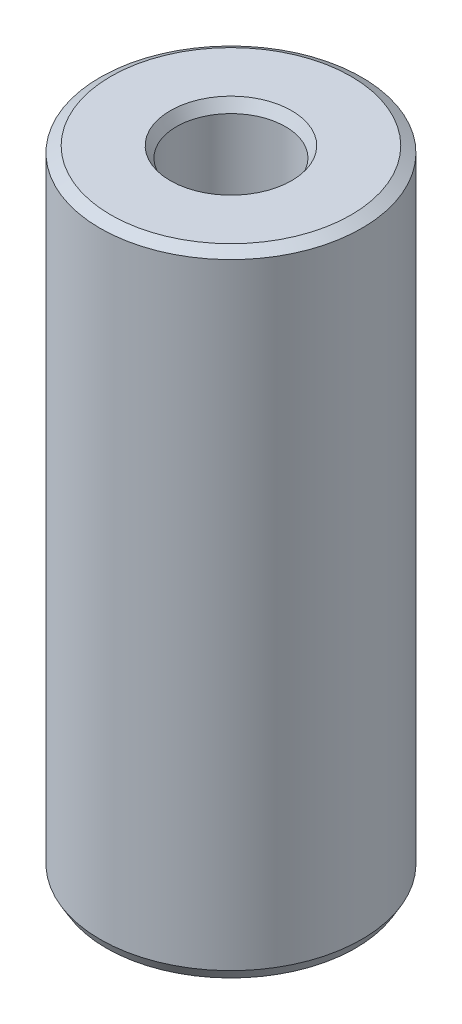
ISO-10303-21;
HEADER;
FILE_DESCRIPTION(('STEP AP214'),'2;1');
FILE_NAME('part.step','',(''),(''),'','','');
FILE_SCHEMA(('AUTOMOTIVE_DESIGN { 1 0 10303 214 1 1 1 1 }'));
ENDSEC;
DATA;
#1=APPLICATION_CONTEXT('core data for automotive mechanical design processes');
#2=APPLICATION_PROTOCOL_DEFINITION('international standard','automotive_design',2000,#1);
#3=PRODUCT_CONTEXT('',#1,'mechanical');
#4=PRODUCT('Part','Part','',(#3));
#5=PRODUCT_RELATED_PRODUCT_CATEGORY('part','',(#4));
#6=PRODUCT_DEFINITION_FORMATION('','',#4);
#7=PRODUCT_DEFINITION_CONTEXT('part definition',#1,'design');
#8=PRODUCT_DEFINITION('design','',#6,#7);
#9=PRODUCT_DEFINITION_SHAPE('','',#8);
#10=(LENGTH_UNIT() NAMED_UNIT(*) SI_UNIT(.MILLI.,.METRE.));
#11=(NAMED_UNIT(*) PLANE_ANGLE_UNIT() SI_UNIT($,.RADIAN.));
#12=(NAMED_UNIT(*) SI_UNIT($,.STERADIAN.) SOLID_ANGLE_UNIT());
#13=UNCERTAINTY_MEASURE_WITH_UNIT(LENGTH_MEASURE(1.E-05),#10,'distance_accuracy_value','');
#14=(GEOMETRIC_REPRESENTATION_CONTEXT(3) GLOBAL_UNCERTAINTY_ASSIGNED_CONTEXT((#13)) GLOBAL_UNIT_ASSIGNED_CONTEXT((#10,
#11,#12)) REPRESENTATION_CONTEXT('',''));
#15=CARTESIAN_POINT('',(0.,0.,0.));
#16=DIRECTION('',(0.,0.,1.));
#17=DIRECTION('',(1.,0.,0.));
#18=AXIS2_PLACEMENT_3D('',#15,#16,#17);
#19=CARTESIAN_POINT('',(0.,278.101247653803,0.));
#20=DIRECTION('',(0.,-1.,0.));
#21=DIRECTION('',(0.,0.,-1.));
#22=AXIS2_PLACEMENT_3D('',#19,#20,#21);
#23=CYLINDRICAL_SURFACE('',#22,57.5);
#24=CARTESIAN_POINT('',(0.,4.71652460681038,0.));
#25=DIRECTION('',(0.,1.,0.));
#26=DIRECTION('',(0.,0.,1.));
#27=AXIS2_PLACEMENT_3D('',#24,#25,#26);
#28=CIRCLE('',#27,57.5);
#29=CARTESIAN_POINT('',(0.,4.71652460681038,57.5));
#30=VERTEX_POINT('',#29);
#31=EDGE_CURVE('E10',#30,#30,#28,.T.);
#32=ORIENTED_EDGE('',*,*,#31,.T.);
#33=EDGE_LOOP('',(#32));
#34=FACE_BOUND('',#33,.T.);
#35=CARTESIAN_POINT('',(0.,275.378160902422,0.));
#36=DIRECTION('',(0.,1.,0.));
#37=DIRECTION('',(0.,0.,1.));
#38=AXIS2_PLACEMENT_3D('',#35,#36,#37);
#39=CIRCLE('',#38,57.5);
#40=CARTESIAN_POINT('',(0.,275.378160902422,57.5));
#41=VERTEX_POINT('',#40);
#42=EDGE_CURVE('E50',#41,#41,#39,.F.);
#43=ORIENTED_EDGE('',*,*,#42,.T.);
#44=EDGE_LOOP('',(#43));
#45=FACE_BOUND('',#44,.T.);
#46=ADVANCED_FACE('F39',(#34,#45),#23,.T.);
#47=CARTESIAN_POINT('',(0.,278.101247653803,0.));
#48=DIRECTION('',(0.,1.,0.));
#49=DIRECTION('',(0.,0.,1.));
#50=AXIS2_PLACEMENT_3D('',#47,#48,#49);
#51=PLANE('',#50);
#52=CARTESIAN_POINT('',(0.,278.101247653803,0.));
#53=DIRECTION('',(0.,1.,0.));
#54=DIRECTION('',(0.,0.,1.));
#55=AXIS2_PLACEMENT_3D('',#52,#53,#54);
#56=CIRCLE('',#55,26.6731437150087);
#57=CARTESIAN_POINT('',(0.,278.101247653803,26.6731437150087));
#58=VERTEX_POINT('',#57);
#59=EDGE_CURVE('E58',#58,#58,#56,.F.);
#60=ORIENTED_EDGE('',*,*,#59,.T.);
#61=EDGE_LOOP('',(#60));
#62=FACE_BOUND('',#61,.T.);
#63=CARTESIAN_POINT('',(0.,278.101247653803,0.));
#64=DIRECTION('',(0.,1.,0.));
#65=DIRECTION('',(0.,0.,1.));
#66=AXIS2_PLACEMENT_3D('',#63,#64,#65);
#67=CIRCLE('',#66,52.7834753931897);
#68=CARTESIAN_POINT('',(0.,278.101247653803,52.7834753931897));
#69=VERTEX_POINT('',#68);
#70=EDGE_CURVE('E61',#69,#69,#67,.T.);
#71=ORIENTED_EDGE('',*,*,#70,.T.);
#72=EDGE_LOOP('',(#71));
#73=FACE_BOUND('',#72,.T.);
#74=ADVANCED_FACE('F88',(#62,#73),#51,.T.);
#75=CARTESIAN_POINT('',(0.,0.,0.));
#76=DIRECTION('',(0.,1.,0.));
#77=DIRECTION('',(0.,0.,1.));
#78=AXIS2_PLACEMENT_3D('',#75,#76,#77);
#79=PLANE('',#78);
#80=CARTESIAN_POINT('',(0.,0.,0.));
#81=DIRECTION('',(0.,1.,0.));
#82=DIRECTION('',(0.,0.,1.));
#83=AXIS2_PLACEMENT_3D('',#80,#81,#82);
#84=CIRCLE('',#83,28.6665815704376);
#85=CARTESIAN_POINT('',(0.,0.,28.6665815704376));
#86=VERTEX_POINT('',#85);
#87=EDGE_CURVE('E51',#86,#86,#84,.T.);
#88=ORIENTED_EDGE('',*,*,#87,.T.);
#89=EDGE_LOOP('',(#88));
#90=FACE_BOUND('',#89,.T.);
#91=CARTESIAN_POINT('',(0.,0.,0.));
#92=DIRECTION('',(0.,1.,0.));
#93=DIRECTION('',(0.,0.,1.));
#94=AXIS2_PLACEMENT_3D('',#91,#92,#93);
#95=CIRCLE('',#94,54.7769132486185);
#96=CARTESIAN_POINT('',(0.,0.,54.7769132486185));
#97=VERTEX_POINT('',#96);
#98=EDGE_CURVE('E54',#97,#97,#95,.F.);
#99=ORIENTED_EDGE('',*,*,#98,.T.);
#100=EDGE_LOOP('',(#99));
#101=FACE_BOUND('',#100,.T.);
#102=ADVANCED_FACE('F83',(#90,#101),#79,.F.);
#103=CARTESIAN_POINT('',(0.,278.101247653803,0.));
#104=DIRECTION('',(0.,-1.,0.));
#105=DIRECTION('',(0.,0.,-1.));
#106=AXIS2_PLACEMENT_3D('',#103,#104,#105);
#107=CYLINDRICAL_SURFACE('',#106,23.9500569636272);
#108=CARTESIAN_POINT('',(0.,273.384723046993,0.));
#109=DIRECTION('',(0.,1.,0.));
#110=DIRECTION('',(0.,0.,1.));
#111=AXIS2_PLACEMENT_3D('',#108,#109,#110);
#112=CIRCLE('',#111,23.9500569636272);
#113=CARTESIAN_POINT('',(0.,273.384723046993,23.9500569636271));
#114=VERTEX_POINT('',#113);
#115=EDGE_CURVE('E67',#114,#114,#112,.T.);
#116=ORIENTED_EDGE('',*,*,#115,.T.);
#117=EDGE_LOOP('',(#116));
#118=FACE_BOUND('',#117,.T.);
#119=CARTESIAN_POINT('',(0.,2.7230867513815,0.));
#120=DIRECTION('',(0.,1.,0.));
#121=DIRECTION('',(0.,0.,1.));
#122=AXIS2_PLACEMENT_3D('',#119,#120,#121);
#123=CIRCLE('',#122,23.9500569636272);
#124=CARTESIAN_POINT('',(0.,2.7230867513815,23.9500569636272));
#125=VERTEX_POINT('',#124);
#126=EDGE_CURVE('E69',#125,#125,#123,.F.);
#127=ORIENTED_EDGE('',*,*,#126,.T.);
#128=EDGE_LOOP('',(#127));
#129=FACE_BOUND('',#128,.T.);
#130=ADVANCED_FACE('F71',(#118,#129),#107,.F.);
#131=CARTESIAN_POINT('',(0.,273.384723046993,0.));
#132=DIRECTION('',(0.,1.,0.));
#133=DIRECTION('',(0.,0.,1.));
#134=AXIS2_PLACEMENT_3D('',#131,#132,#133);
#135=CONICAL_SURFACE('',#134,23.9500569636272,0.5235987755983);
#136=CARTESIAN_POINT('',(0.,278.101247653803,26.6731437150087));
#137=CARTESIAN_POINT('',(0.,278.052117189149,26.6447782280152));
#138=CARTESIAN_POINT('',(0.,278.002986724495,26.6164127410216));
#139=CARTESIAN_POINT('',(0.,277.904725795186,26.5596817670345));
#140=CARTESIAN_POINT('',(0.,277.855595330532,26.5313162800409));
#141=CARTESIAN_POINT('',(0.,277.757334401223,26.4745853060538));
#142=CARTESIAN_POINT('',(0.,277.708203936569,26.4462198190603));
#143=CARTESIAN_POINT('',(0.,277.60994300726,26.3894888450731));
#144=CARTESIAN_POINT('',(0.,277.560812542606,26.3611233580796));
#145=CARTESIAN_POINT('',(0.,277.462551613298,26.3043923840925));
#146=CARTESIAN_POINT('',(0.,277.413421148643,26.2760268970989));
#147=CARTESIAN_POINT('',(0.,277.315160219335,26.2192959231118));
#148=CARTESIAN_POINT('',(0.,277.26602975468,26.1909304361182));
#149=CARTESIAN_POINT('',(0.,277.167768825372,26.1341994621311));
#150=CARTESIAN_POINT('',(0.,277.118638360718,26.1058339751376));
#151=CARTESIAN_POINT('',(0.,277.020377431409,26.0491030011504));
#152=CARTESIAN_POINT('',(0.,276.971246966755,26.0207375141569));
#153=CARTESIAN_POINT('',(0.,276.872986037446,25.9640065401698));
#154=CARTESIAN_POINT('',(0.,276.823855572792,25.9356410531762));
#155=CARTESIAN_POINT('',(0.,276.725594643483,25.8789100791891));
#156=CARTESIAN_POINT('',(0.,276.676464178829,25.8505445921955));
#157=CARTESIAN_POINT('',(0.,276.578203249521,25.7938136182084));
#158=CARTESIAN_POINT('',(0.,276.529072784866,25.7654481312149));
#159=CARTESIAN_POINT('',(0.,276.430811855558,25.7087171572277));
#160=CARTESIAN_POINT('',(0.,276.381681390903,25.6803516702342));
#161=CARTESIAN_POINT('',(0.,276.283420461595,25.6236206962471));
#162=CARTESIAN_POINT('',(0.,276.234289996941,25.5952552092535));
#163=CARTESIAN_POINT('',(0.,276.136029067632,25.5385242352664));
#164=CARTESIAN_POINT('',(0.,276.086898602978,25.5101587482728));
#165=CARTESIAN_POINT('',(0.,275.988637673669,25.4534277742857));
#166=CARTESIAN_POINT('',(0.,275.939507209015,25.4250622872922));
#167=CARTESIAN_POINT('',(0.,275.841246279706,25.3683313133051));
#168=CARTESIAN_POINT('',(0.,275.792115815052,25.3399658263115));
#169=CARTESIAN_POINT('',(0.,275.693854885744,25.2832348523244));
#170=CARTESIAN_POINT('',(0.,275.644724421089,25.2548693653308));
#171=CARTESIAN_POINT('',(0.,275.546463491781,25.1981383913437));
#172=CARTESIAN_POINT('',(0.,275.497333027126,25.1697729043501));
#173=CARTESIAN_POINT('',(0.,275.399072097818,25.113041930363));
#174=CARTESIAN_POINT('',(0.,275.349941633164,25.0846764433695));
#175=CARTESIAN_POINT('',(0.,275.251680703855,25.0279454693823));
#176=CARTESIAN_POINT('',(0.,275.202550239201,24.9995799823888));
#177=CARTESIAN_POINT('',(0.,275.104289309892,24.9428490084017));
#178=CARTESIAN_POINT('',(0.,275.055158845238,24.9144835214081));
#179=CARTESIAN_POINT('',(0.,274.956897915929,24.857752547421));
#180=CARTESIAN_POINT('',(0.,274.907767451275,24.8293870604275));
#181=CARTESIAN_POINT('',(0.,274.809506521967,24.7726560864403));
#182=CARTESIAN_POINT('',(0.,274.760376057312,24.7442905994468));
#183=CARTESIAN_POINT('',(0.,274.662115128004,24.6875596254597));
#184=CARTESIAN_POINT('',(0.,274.612984663349,24.6591941384661));
#185=CARTESIAN_POINT('',(0.,274.514723734041,24.602463164479));
#186=CARTESIAN_POINT('',(0.,274.465593269387,24.5740976774854));
#187=CARTESIAN_POINT('',(0.,274.367332340078,24.5173667034983));
#188=CARTESIAN_POINT('',(0.,274.318201875424,24.4890012165048));
#189=CARTESIAN_POINT('',(0.,274.219940946115,24.4322702425176));
#190=CARTESIAN_POINT('',(0.,274.170810481461,24.4039047555241));
#191=CARTESIAN_POINT('',(0.,274.072549552152,24.347173781537));
#192=CARTESIAN_POINT('',(0.,274.023419087498,24.3188082945434));
#193=CARTESIAN_POINT('',(0.,273.92515815819,24.2620773205563));
#194=CARTESIAN_POINT('',(0.,273.876027693535,24.2337118335627));
#195=CARTESIAN_POINT('',(0.,273.777766764227,24.1769808595756));
#196=CARTESIAN_POINT('',(0.,273.728636299572,24.1486153725821));
#197=CARTESIAN_POINT('',(0.,273.630375370264,24.0918843985949));
#198=CARTESIAN_POINT('',(0.,273.58124490561,24.0635189116014));
#199=CARTESIAN_POINT('',(0.,273.482983976301,24.0067879376143));
#200=CARTESIAN_POINT('',(0.,273.433853511647,23.9784224506207));
#201=CARTESIAN_POINT('',(0.,273.384723046993,23.9500569636271));
#202=B_SPLINE_CURVE_WITH_KNOTS('',3,(#136,#137,#138,#139,#140,#141,#142,#143,#144,#145,#146,
#147,#148,#149,#150,#151,#152,#153,#154,#155,#156,#157,#158,#159,#160,#161,#162,#163,#164,#165,
#166,#167,#168,#169,#170,#171,#172,#173,#174,#175,#176,#177,#178,#179,#180,#181,#182,#183,#184,
#185,#186,#187,#188,#189,#190,#191,#192,#193,#194,#195,#196,#197,#198,#199,#200,#201),
.UNSPECIFIED.,.F.,.F.,(4,2,2,2,2,2,2,2,2,2,2,2,2,2,2,2,2,2,2,2,2,2,2,2,2,2,2,2,2,2,2,2,4),(0.,
0.170192921961375,0.3403858439227,0.510578765884073,0.680771687845398,0.850964609806771,
1.0211575317681,1.19135045372947,1.36154337569079,1.53173629765217,1.70192921961349,
1.87212214157487,2.04231506353619,2.21250798549756,2.38270090745889,2.55289382942026,
2.72308675138159,2.89327967334291,3.06347259530429,3.23366551726561,3.40385843922699,
3.57405136118831,3.74424428314968,3.91443720511101,4.08463012707238,4.25482304903371,
4.42501597099508,4.59520889295641,4.76540181491778,4.9355947368791,5.10578765884048,
5.2759805808018,5.44617350276313),.UNSPECIFIED.);
#203=EDGE_CURVE('BSEAM77',#58,#114,#202,.T.);
#204=ORIENTED_EDGE('',*,*,#59,.F.);
#205=ORIENTED_EDGE('',*,*,#115,.F.);
#206=ORIENTED_EDGE('',*,*,#203,.T.);
#207=ORIENTED_EDGE('',*,*,#203,.F.);
#208=EDGE_LOOP('',(#204,#206,#205,#207));
#209=FACE_BOUND('',#208,.T.);
#210=ADVANCED_FACE('F77',(#209),#135,.F.);
#211=CARTESIAN_POINT('',(0.,0.,0.));
#212=DIRECTION('',(0.,-1.,0.));
#213=DIRECTION('',(0.,0.,-1.));
#214=AXIS2_PLACEMENT_3D('',#211,#212,#213);
#215=CONICAL_SURFACE('',#214,28.6665815704376,1.04719755119659);
#216=ORIENTED_EDGE('',*,*,#126,.F.);
#217=EDGE_LOOP('',(#216));
#218=FACE_BOUND('',#217,.T.);
#219=ORIENTED_EDGE('',*,*,#87,.F.);
#220=EDGE_LOOP('',(#219));
#221=FACE_BOUND('',#220,.T.);
#222=ADVANCED_FACE('F73',(#218,#221),#215,.F.);
#223=CARTESIAN_POINT('',(0.,4.71652460681038,0.));
#224=DIRECTION('',(0.,1.,0.));
#225=DIRECTION('',(0.,0.,1.));
#226=AXIS2_PLACEMENT_3D('',#223,#224,#225);
#227=CONICAL_SURFACE('',#226,57.5,0.523598775598307);
#228=ORIENTED_EDGE('',*,*,#98,.F.);
#229=EDGE_LOOP('',(#228));
#230=FACE_BOUND('',#229,.T.);
#231=ORIENTED_EDGE('',*,*,#31,.F.);
#232=EDGE_LOOP('',(#231));
#233=FACE_BOUND('',#232,.T.);
#234=ADVANCED_FACE('F76',(#230,#233),#227,.T.);
#235=CARTESIAN_POINT('',(0.,278.101247653803,0.));
#236=DIRECTION('',(0.,-1.,0.));
#237=DIRECTION('',(0.,0.,-1.));
#238=AXIS2_PLACEMENT_3D('',#235,#236,#237);
#239=CONICAL_SURFACE('',#238,52.7834753931897,1.04719755119659);
#240=ORIENTED_EDGE('',*,*,#42,.F.);
#241=EDGE_LOOP('',(#240));
#242=FACE_BOUND('',#241,.T.);
#243=ORIENTED_EDGE('',*,*,#70,.F.);
#244=EDGE_LOOP('',(#243));
#245=FACE_BOUND('',#244,.T.);
#246=ADVANCED_FACE('F45',(#242,#245),#239,.T.);
#247=CLOSED_SHELL('',(#46,#74,#102,#130,#210,#222,#234,#246));
#248=MANIFOLD_SOLID_BREP('B2',#247);
#249=ADVANCED_BREP_SHAPE_REPRESENTATION('',(#18,#248),#14);
#250=SHAPE_DEFINITION_REPRESENTATION(#9,#249);
ENDSEC;
END-ISO-10303-21;
